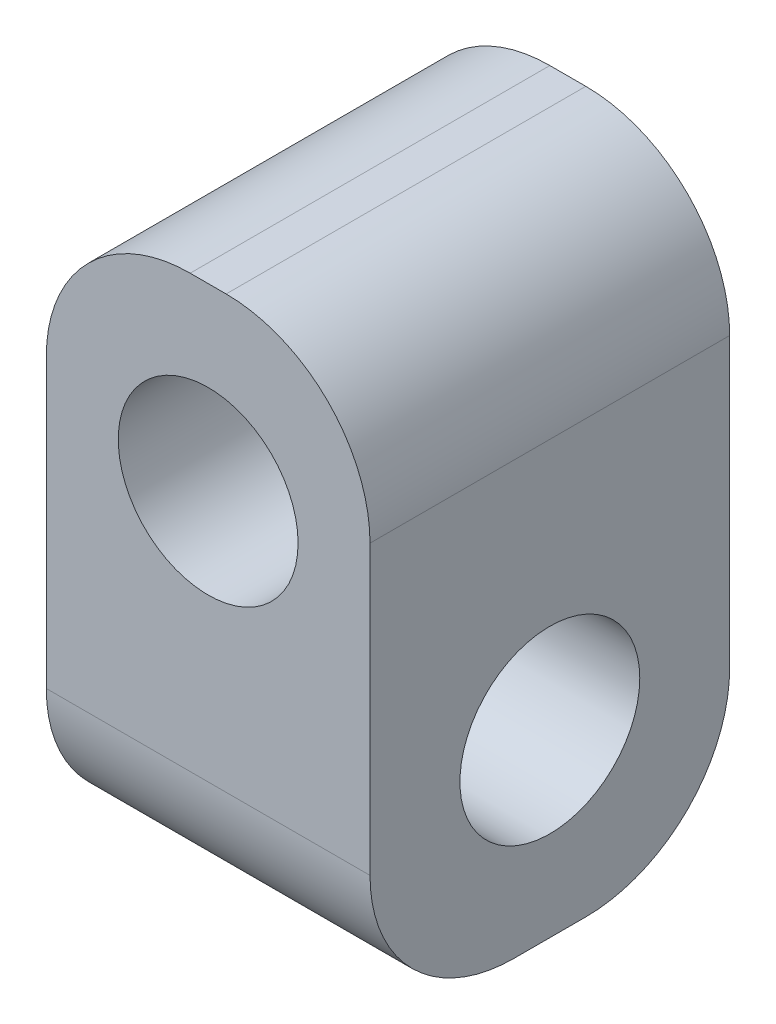
ISO-10303-21;
HEADER;
FILE_DESCRIPTION(('STEP AP214'),'2;1');
FILE_NAME('part.step','',(''),(''),'','','');
FILE_SCHEMA(('AUTOMOTIVE_DESIGN { 1 0 10303 214 1 1 1 1 }'));
ENDSEC;
DATA;
#1=APPLICATION_CONTEXT('core data for automotive mechanical design processes');
#2=APPLICATION_PROTOCOL_DEFINITION('international standard','automotive_design',2000,#1);
#3=PRODUCT_CONTEXT('',#1,'mechanical');
#4=PRODUCT('Part','Part','',(#3));
#5=PRODUCT_RELATED_PRODUCT_CATEGORY('part','',(#4));
#6=PRODUCT_DEFINITION_FORMATION('','',#4);
#7=PRODUCT_DEFINITION_CONTEXT('part definition',#1,'design');
#8=PRODUCT_DEFINITION('design','',#6,#7);
#9=PRODUCT_DEFINITION_SHAPE('','',#8);
#10=(LENGTH_UNIT() NAMED_UNIT(*) SI_UNIT(.MILLI.,.METRE.));
#11=(NAMED_UNIT(*) PLANE_ANGLE_UNIT() SI_UNIT($,.RADIAN.));
#12=(NAMED_UNIT(*) SI_UNIT($,.STERADIAN.) SOLID_ANGLE_UNIT());
#13=UNCERTAINTY_MEASURE_WITH_UNIT(LENGTH_MEASURE(1.E-05),#10,'distance_accuracy_value','');
#14=(GEOMETRIC_REPRESENTATION_CONTEXT(3) GLOBAL_UNCERTAINTY_ASSIGNED_CONTEXT((#13)) GLOBAL_UNIT_ASSIGNED_CONTEXT((#10,
#11,#12)) REPRESENTATION_CONTEXT('',''));
#15=CARTESIAN_POINT('',(0.,0.,0.));
#16=DIRECTION('',(0.,0.,1.));
#17=DIRECTION('',(1.,0.,0.));
#18=AXIS2_PLACEMENT_3D('',#15,#16,#17);
#19=CARTESIAN_POINT('',(-2.5,5.,50.));
#20=DIRECTION('',(0.,0.,1.));
#21=DIRECTION('',(1.,0.,0.));
#22=AXIS2_PLACEMENT_3D('',#19,#20,#21);
#23=PLANE('',#22);
#24=DIRECTION('',(0.,-1.,0.));
#25=VECTOR('',#24,1.);
#26=CARTESIAN_POINT('',(-22.5,-15.,50.));
#27=LINE('',#26,#25);
#28=CARTESIAN_POINT('',(-22.5,4.99999999999999,50.));
#29=VERTEX_POINT('',#28);
#30=CARTESIAN_POINT('',(-22.5,-35.,50.));
#31=VERTEX_POINT('',#30);
#32=EDGE_CURVE('E133',#29,#31,#27,.T.);
#33=ORIENTED_EDGE('',*,*,#32,.T.);
#34=DIRECTION('',(-1.,0.,0.));
#35=VECTOR('',#34,1.);
#36=CARTESIAN_POINT('',(22.5,-35.,50.));
#37=LINE('',#36,#35);
#38=CARTESIAN_POINT('',(22.5,-35.,50.));
#39=VERTEX_POINT('',#38);
#40=EDGE_CURVE('E130',#39,#31,#37,.T.);
#41=ORIENTED_EDGE('',*,*,#40,.F.);
#42=DIRECTION('',(0.,1.,0.));
#43=VECTOR('',#42,1.);
#44=CARTESIAN_POINT('',(22.5,5.,50.));
#45=LINE('',#44,#43);
#46=CARTESIAN_POINT('',(22.5,5.,50.));
#47=VERTEX_POINT('',#46);
#48=EDGE_CURVE('E96',#39,#47,#45,.T.);
#49=ORIENTED_EDGE('',*,*,#48,.T.);
#50=CARTESIAN_POINT('',(2.50000000000001,5.,50.));
#51=DIRECTION('',(0.,0.,1.));
#52=DIRECTION('',(1.,0.,0.));
#53=AXIS2_PLACEMENT_3D('',#50,#51,#52);
#54=CIRCLE('',#53,20.);
#55=CARTESIAN_POINT('',(2.5,25.,50.));
#56=VERTEX_POINT('',#55);
#57=EDGE_CURVE('E126',#47,#56,#54,.T.);
#58=ORIENTED_EDGE('',*,*,#57,.T.);
#59=DIRECTION('',(-1.,0.,0.));
#60=VECTOR('',#59,1.);
#61=CARTESIAN_POINT('',(-2.5,25.,50.));
#62=LINE('',#61,#60);
#63=CARTESIAN_POINT('',(-2.5,25.,50.));
#64=VERTEX_POINT('',#63);
#65=EDGE_CURVE('E187',#56,#64,#62,.T.);
#66=ORIENTED_EDGE('',*,*,#65,.T.);
#67=CARTESIAN_POINT('',(-2.5,5.,50.));
#68=DIRECTION('',(0.,0.,1.));
#69=DIRECTION('',(1.,0.,0.));
#70=AXIS2_PLACEMENT_3D('',#67,#68,#69);
#71=CIRCLE('',#70,20.);
#72=EDGE_CURVE('E65',#64,#29,#71,.T.);
#73=ORIENTED_EDGE('',*,*,#72,.T.);
#74=EDGE_LOOP('',(#33,#41,#49,#58,#66,#73));
#75=FACE_BOUND('',#74,.T.);
#76=CARTESIAN_POINT('',(0.,0.,50.));
#77=DIRECTION('',(0.,0.,1.));
#78=DIRECTION('',(1.,0.,0.));
#79=AXIS2_PLACEMENT_3D('',#76,#77,#78);
#80=CIRCLE('',#79,12.5);
#81=CARTESIAN_POINT('',(12.5,0.,50.));
#82=VERTEX_POINT('',#81);
#83=EDGE_CURVE('E177',#82,#82,#80,.T.);
#84=ORIENTED_EDGE('',*,*,#83,.F.);
#85=EDGE_LOOP('',(#84));
#86=FACE_BOUND('',#85,.T.);
#87=ADVANCED_FACE('F47',(#75,#86),#23,.T.);
#88=CARTESIAN_POINT('',(-2.5,5.,0.));
#89=DIRECTION('',(0.,0.,1.));
#90=DIRECTION('',(1.,0.,0.));
#91=AXIS2_PLACEMENT_3D('',#88,#89,#90);
#92=PLANE('',#91);
#93=DIRECTION('',(0.,1.,0.));
#94=VECTOR('',#93,1.);
#95=CARTESIAN_POINT('',(22.5,5.,0.));
#96=LINE('',#95,#94);
#97=CARTESIAN_POINT('',(22.5,-35.,0.));
#98=VERTEX_POINT('',#97);
#99=CARTESIAN_POINT('',(22.5,5.,0.));
#100=VERTEX_POINT('',#99);
#101=EDGE_CURVE('E181',#98,#100,#96,.T.);
#102=ORIENTED_EDGE('',*,*,#101,.F.);
#103=DIRECTION('',(-1.,0.,0.));
#104=VECTOR('',#103,1.);
#105=CARTESIAN_POINT('',(22.5,-35.,0.));
#106=LINE('',#105,#104);
#107=CARTESIAN_POINT('',(-22.5,-35.,0.));
#108=VERTEX_POINT('',#107);
#109=EDGE_CURVE('E161',#98,#108,#106,.T.);
#110=ORIENTED_EDGE('',*,*,#109,.T.);
#111=DIRECTION('',(0.,-1.,0.));
#112=VECTOR('',#111,1.);
#113=CARTESIAN_POINT('',(-22.5,-15.,0.));
#114=LINE('',#113,#112);
#115=CARTESIAN_POINT('',(-22.5,4.99999999999999,0.));
#116=VERTEX_POINT('',#115);
#117=EDGE_CURVE('E127',#116,#108,#114,.T.);
#118=ORIENTED_EDGE('',*,*,#117,.F.);
#119=CARTESIAN_POINT('',(-2.5,5.,0.));
#120=DIRECTION('',(0.,0.,1.));
#121=DIRECTION('',(1.,0.,0.));
#122=AXIS2_PLACEMENT_3D('',#119,#120,#121);
#123=CIRCLE('',#122,20.);
#124=CARTESIAN_POINT('',(-2.5,25.,0.));
#125=VERTEX_POINT('',#124);
#126=EDGE_CURVE('E89',#125,#116,#123,.T.);
#127=ORIENTED_EDGE('',*,*,#126,.F.);
#128=DIRECTION('',(-1.,0.,0.));
#129=VECTOR('',#128,1.);
#130=CARTESIAN_POINT('',(-2.5,25.,0.));
#131=LINE('',#130,#129);
#132=CARTESIAN_POINT('',(2.5,25.,0.));
#133=VERTEX_POINT('',#132);
#134=EDGE_CURVE('E83',#133,#125,#131,.T.);
#135=ORIENTED_EDGE('',*,*,#134,.F.);
#136=CARTESIAN_POINT('',(2.50000000000001,5.,0.));
#137=DIRECTION('',(0.,0.,1.));
#138=DIRECTION('',(1.,0.,0.));
#139=AXIS2_PLACEMENT_3D('',#136,#137,#138);
#140=CIRCLE('',#139,20.);
#141=EDGE_CURVE('E197',#100,#133,#140,.T.);
#142=ORIENTED_EDGE('',*,*,#141,.F.);
#143=EDGE_LOOP('',(#102,#110,#118,#127,#135,#142));
#144=FACE_BOUND('',#143,.T.);
#145=CARTESIAN_POINT('',(0.,0.,0.));
#146=DIRECTION('',(0.,0.,1.));
#147=DIRECTION('',(1.,0.,0.));
#148=AXIS2_PLACEMENT_3D('',#145,#146,#147);
#149=CIRCLE('',#148,12.5);
#150=CARTESIAN_POINT('',(12.5,0.,0.));
#151=VERTEX_POINT('',#150);
#152=EDGE_CURVE('E137',#151,#151,#149,.T.);
#153=ORIENTED_EDGE('',*,*,#152,.T.);
#154=EDGE_LOOP('',(#153));
#155=FACE_BOUND('',#154,.T.);
#156=ADVANCED_FACE('F217',(#144,#155),#92,.F.);
#157=CARTESIAN_POINT('',(22.5,5.,50.));
#158=DIRECTION('',(-1.,0.,0.));
#159=DIRECTION('',(0.,-1.,0.));
#160=AXIS2_PLACEMENT_3D('',#157,#158,#159);
#161=PLANE('',#160);
#162=ORIENTED_EDGE('',*,*,#101,.T.);
#163=DIRECTION('',(0.,0.,-1.));
#164=VECTOR('',#163,1.);
#165=CARTESIAN_POINT('',(22.5,5.,50.));
#166=LINE('',#165,#164);
#167=EDGE_CURVE('E11',#47,#100,#166,.T.);
#168=ORIENTED_EDGE('',*,*,#167,.F.);
#169=ORIENTED_EDGE('',*,*,#48,.F.);
#170=CARTESIAN_POINT('',(22.5,-35.,30.));
#171=DIRECTION('',(1.,0.,0.));
#172=DIRECTION('',(0.,0.,-1.));
#173=AXIS2_PLACEMENT_3D('',#170,#171,#172);
#174=CIRCLE('',#173,20.);
#175=CARTESIAN_POINT('',(22.5,-55.,30.));
#176=VERTEX_POINT('',#175);
#177=EDGE_CURVE('E122',#39,#176,#174,.T.);
#178=ORIENTED_EDGE('',*,*,#177,.T.);
#179=DIRECTION('',(0.,0.,-1.));
#180=VECTOR('',#179,1.);
#181=CARTESIAN_POINT('',(22.5,-55.,30.));
#182=LINE('',#181,#180);
#183=CARTESIAN_POINT('',(22.5,-55.,20.));
#184=VERTEX_POINT('',#183);
#185=EDGE_CURVE('E144',#176,#184,#182,.T.);
#186=ORIENTED_EDGE('',*,*,#185,.T.);
#187=CARTESIAN_POINT('',(22.5,-35.,20.));
#188=DIRECTION('',(1.,0.,0.));
#189=DIRECTION('',(0.,0.,1.));
#190=AXIS2_PLACEMENT_3D('',#187,#188,#189);
#191=CIRCLE('',#190,20.);
#192=EDGE_CURVE('E149',#184,#98,#191,.T.);
#193=ORIENTED_EDGE('',*,*,#192,.T.);
#194=EDGE_LOOP('',(#162,#168,#169,#178,#186,#193));
#195=FACE_BOUND('',#194,.T.);
#196=CARTESIAN_POINT('',(22.5,-30.,25.));
#197=DIRECTION('',(1.,0.,0.));
#198=DIRECTION('',(0.,0.,-1.));
#199=AXIS2_PLACEMENT_3D('',#196,#197,#198);
#200=CIRCLE('',#199,12.5);
#201=CARTESIAN_POINT('',(22.5,-30.,12.5));
#202=VERTEX_POINT('',#201);
#203=EDGE_CURVE('E165',#202,#202,#200,.T.);
#204=ORIENTED_EDGE('',*,*,#203,.F.);
#205=EDGE_LOOP('',(#204));
#206=FACE_BOUND('',#205,.T.);
#207=ADVANCED_FACE('F49',(#195,#206),#161,.F.);
#208=CARTESIAN_POINT('',(2.50000000000001,5.,50.));
#209=DIRECTION('',(0.,0.,-1.));
#210=DIRECTION('',(-1.,0.,0.));
#211=AXIS2_PLACEMENT_3D('',#208,#209,#210);
#212=CYLINDRICAL_SURFACE('',#211,20.);
#213=ORIENTED_EDGE('',*,*,#141,.T.);
#214=DIRECTION('',(0.,0.,-1.));
#215=VECTOR('',#214,1.);
#216=CARTESIAN_POINT('',(2.5,25.,50.));
#217=LINE('',#216,#215);
#218=EDGE_CURVE('E57',#56,#133,#217,.T.);
#219=ORIENTED_EDGE('',*,*,#218,.F.);
#220=ORIENTED_EDGE('',*,*,#57,.F.);
#221=ORIENTED_EDGE('',*,*,#167,.T.);
#222=EDGE_LOOP('',(#213,#219,#220,#221));
#223=FACE_BOUND('',#222,.T.);
#224=ADVANCED_FACE('F232',(#223),#212,.T.);
#225=CARTESIAN_POINT('',(-2.5,25.,50.));
#226=DIRECTION('',(0.,-1.,0.));
#227=DIRECTION('',(0.,0.,-1.));
#228=AXIS2_PLACEMENT_3D('',#225,#226,#227);
#229=PLANE('',#228);
#230=ORIENTED_EDGE('',*,*,#134,.T.);
#231=DIRECTION('',(0.,0.,-1.));
#232=VECTOR('',#231,1.);
#233=CARTESIAN_POINT('',(-2.5,25.,50.));
#234=LINE('',#233,#232);
#235=EDGE_CURVE('E208',#64,#125,#234,.T.);
#236=ORIENTED_EDGE('',*,*,#235,.F.);
#237=ORIENTED_EDGE('',*,*,#65,.F.);
#238=ORIENTED_EDGE('',*,*,#218,.T.);
#239=EDGE_LOOP('',(#230,#236,#237,#238));
#240=FACE_BOUND('',#239,.T.);
#241=ADVANCED_FACE('F213',(#240),#229,.F.);
#242=CARTESIAN_POINT('',(-2.5,5.,50.));
#243=DIRECTION('',(0.,0.,-1.));
#244=DIRECTION('',(-1.,0.,0.));
#245=AXIS2_PLACEMENT_3D('',#242,#243,#244);
#246=CYLINDRICAL_SURFACE('',#245,20.);
#247=ORIENTED_EDGE('',*,*,#126,.T.);
#248=DIRECTION('',(0.,0.,-1.));
#249=VECTOR('',#248,1.);
#250=CARTESIAN_POINT('',(-22.5,4.99999999999999,50.));
#251=LINE('',#250,#249);
#252=EDGE_CURVE('E194',#29,#116,#251,.T.);
#253=ORIENTED_EDGE('',*,*,#252,.F.);
#254=ORIENTED_EDGE('',*,*,#72,.F.);
#255=ORIENTED_EDGE('',*,*,#235,.T.);
#256=EDGE_LOOP('',(#247,#253,#254,#255));
#257=FACE_BOUND('',#256,.T.);
#258=ADVANCED_FACE('F233',(#257),#246,.T.);
#259=CARTESIAN_POINT('',(-22.5,-15.,50.));
#260=DIRECTION('',(1.,0.,0.));
#261=DIRECTION('',(0.,1.,0.));
#262=AXIS2_PLACEMENT_3D('',#259,#260,#261);
#263=PLANE('',#262);
#264=ORIENTED_EDGE('',*,*,#117,.T.);
#265=CARTESIAN_POINT('',(-22.5,-35.,20.));
#266=DIRECTION('',(1.,0.,0.));
#267=DIRECTION('',(0.,0.,1.));
#268=AXIS2_PLACEMENT_3D('',#265,#266,#267);
#269=CIRCLE('',#268,20.);
#270=CARTESIAN_POINT('',(-22.5,-55.,20.));
#271=VERTEX_POINT('',#270);
#272=EDGE_CURVE('E145',#271,#108,#269,.T.);
#273=ORIENTED_EDGE('',*,*,#272,.F.);
#274=DIRECTION('',(0.,0.,-1.));
#275=VECTOR('',#274,1.);
#276=CARTESIAN_POINT('',(-22.5,-55.,30.));
#277=LINE('',#276,#275);
#278=CARTESIAN_POINT('',(-22.5,-55.,30.));
#279=VERTEX_POINT('',#278);
#280=EDGE_CURVE('E152',#279,#271,#277,.T.);
#281=ORIENTED_EDGE('',*,*,#280,.F.);
#282=CARTESIAN_POINT('',(-22.5,-35.,30.));
#283=DIRECTION('',(1.,0.,0.));
#284=DIRECTION('',(0.,0.,-1.));
#285=AXIS2_PLACEMENT_3D('',#282,#283,#284);
#286=CIRCLE('',#285,20.);
#287=EDGE_CURVE('E162',#31,#279,#286,.T.);
#288=ORIENTED_EDGE('',*,*,#287,.F.);
#289=ORIENTED_EDGE('',*,*,#32,.F.);
#290=ORIENTED_EDGE('',*,*,#252,.T.);
#291=EDGE_LOOP('',(#264,#273,#281,#288,#289,#290));
#292=FACE_BOUND('',#291,.T.);
#293=CARTESIAN_POINT('',(-22.5,-30.,25.));
#294=DIRECTION('',(1.,0.,0.));
#295=DIRECTION('',(0.,0.,-1.));
#296=AXIS2_PLACEMENT_3D('',#293,#294,#295);
#297=CIRCLE('',#296,12.5);
#298=CARTESIAN_POINT('',(-22.5,-30.,12.5));
#299=VERTEX_POINT('',#298);
#300=EDGE_CURVE('E155',#299,#299,#297,.T.);
#301=ORIENTED_EDGE('',*,*,#300,.T.);
#302=EDGE_LOOP('',(#301));
#303=FACE_BOUND('',#302,.T.);
#304=ADVANCED_FACE('F223',(#292,#303),#263,.F.);
#305=CARTESIAN_POINT('',(0.,0.,50.));
#306=DIRECTION('',(0.,0.,-1.));
#307=DIRECTION('',(-1.,0.,0.));
#308=AXIS2_PLACEMENT_3D('',#305,#306,#307);
#309=CYLINDRICAL_SURFACE('',#308,12.5);
#310=ORIENTED_EDGE('',*,*,#83,.T.);
#311=EDGE_LOOP('',(#310));
#312=FACE_BOUND('',#311,.T.);
#313=ORIENTED_EDGE('',*,*,#152,.F.);
#314=EDGE_LOOP('',(#313));
#315=FACE_BOUND('',#314,.T.);
#316=ADVANCED_FACE('F241',(#312,#315),#309,.F.);
#317=CARTESIAN_POINT('',(22.5,-35.,30.));
#318=DIRECTION('',(-1.,0.,0.));
#319=DIRECTION('',(0.,0.,1.));
#320=AXIS2_PLACEMENT_3D('',#317,#318,#319);
#321=CYLINDRICAL_SURFACE('',#320,20.);
#322=ORIENTED_EDGE('',*,*,#287,.T.);
#323=DIRECTION('',(-1.,0.,0.));
#324=VECTOR('',#323,1.);
#325=CARTESIAN_POINT('',(22.5,-55.,30.));
#326=LINE('',#325,#324);
#327=EDGE_CURVE('E138',#176,#279,#326,.T.);
#328=ORIENTED_EDGE('',*,*,#327,.F.);
#329=ORIENTED_EDGE('',*,*,#177,.F.);
#330=ORIENTED_EDGE('',*,*,#40,.T.);
#331=EDGE_LOOP('',(#322,#328,#329,#330));
#332=FACE_BOUND('',#331,.T.);
#333=ADVANCED_FACE('F140',(#332),#321,.T.);
#334=CARTESIAN_POINT('',(22.5,-55.,30.));
#335=DIRECTION('',(0.,1.,0.));
#336=DIRECTION('',(0.,0.,1.));
#337=AXIS2_PLACEMENT_3D('',#334,#335,#336);
#338=PLANE('',#337);
#339=ORIENTED_EDGE('',*,*,#280,.T.);
#340=DIRECTION('',(-1.,0.,0.));
#341=VECTOR('',#340,1.);
#342=CARTESIAN_POINT('',(22.5,-55.,20.));
#343=LINE('',#342,#341);
#344=EDGE_CURVE('E171',#184,#271,#343,.T.);
#345=ORIENTED_EDGE('',*,*,#344,.F.);
#346=ORIENTED_EDGE('',*,*,#185,.F.);
#347=ORIENTED_EDGE('',*,*,#327,.T.);
#348=EDGE_LOOP('',(#339,#345,#346,#347));
#349=FACE_BOUND('',#348,.T.);
#350=ADVANCED_FACE('F231',(#349),#338,.F.);
#351=CARTESIAN_POINT('',(22.5,-35.,20.));
#352=DIRECTION('',(-1.,0.,0.));
#353=DIRECTION('',(0.,0.,1.));
#354=AXIS2_PLACEMENT_3D('',#351,#352,#353);
#355=CYLINDRICAL_SURFACE('',#354,20.);
#356=ORIENTED_EDGE('',*,*,#272,.T.);
#357=ORIENTED_EDGE('',*,*,#109,.F.);
#358=ORIENTED_EDGE('',*,*,#192,.F.);
#359=ORIENTED_EDGE('',*,*,#344,.T.);
#360=EDGE_LOOP('',(#356,#357,#358,#359));
#361=FACE_BOUND('',#360,.T.);
#362=ADVANCED_FACE('F227',(#361),#355,.T.);
#363=CARTESIAN_POINT('',(22.5,-30.,25.));
#364=DIRECTION('',(-1.,0.,0.));
#365=DIRECTION('',(0.,0.,1.));
#366=AXIS2_PLACEMENT_3D('',#363,#364,#365);
#367=CYLINDRICAL_SURFACE('',#366,12.5);
#368=ORIENTED_EDGE('',*,*,#203,.T.);
#369=EDGE_LOOP('',(#368));
#370=FACE_BOUND('',#369,.T.);
#371=ORIENTED_EDGE('',*,*,#300,.F.);
#372=EDGE_LOOP('',(#371));
#373=FACE_BOUND('',#372,.T.);
#374=ADVANCED_FACE('F259',(#370,#373),#367,.F.);
#375=CLOSED_SHELL('',(#87,#156,#207,#224,#241,#258,#304,#316,#333,#350,#362,#374));
#376=MANIFOLD_SOLID_BREP('B2',#375);
#377=ADVANCED_BREP_SHAPE_REPRESENTATION('',(#18,#376),#14);
#378=SHAPE_DEFINITION_REPRESENTATION(#9,#377);
ENDSEC;
END-ISO-10303-21;
